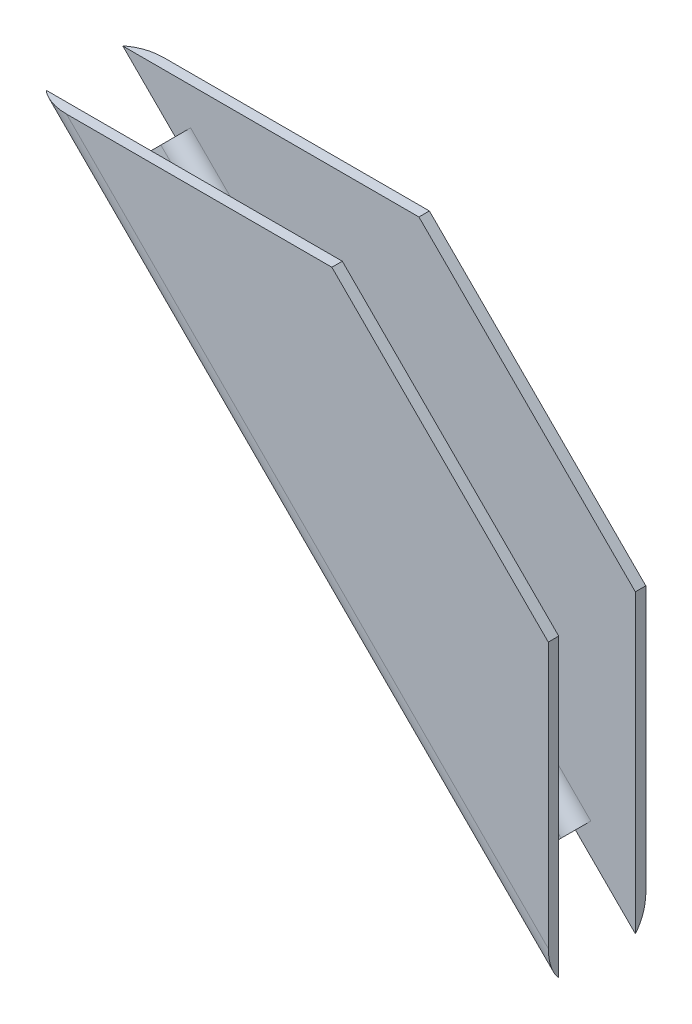
ISO-10303-21;
HEADER;
FILE_DESCRIPTION(('STEP AP214'),'2;1');
FILE_NAME('part.step','',(''),(''),'','','');
FILE_SCHEMA(('AUTOMOTIVE_DESIGN { 1 0 10303 214 1 1 1 1 }'));
ENDSEC;
DATA;
#1=APPLICATION_CONTEXT('core data for automotive mechanical design processes');
#2=APPLICATION_PROTOCOL_DEFINITION('international standard','automotive_design',2000,#1);
#3=PRODUCT_CONTEXT('',#1,'mechanical');
#4=PRODUCT('Part','Part','',(#3));
#5=PRODUCT_RELATED_PRODUCT_CATEGORY('part','',(#4));
#6=PRODUCT_DEFINITION_FORMATION('','',#4);
#7=PRODUCT_DEFINITION_CONTEXT('part definition',#1,'design');
#8=PRODUCT_DEFINITION('design','',#6,#7);
#9=PRODUCT_DEFINITION_SHAPE('','',#8);
#10=(LENGTH_UNIT() NAMED_UNIT(*) SI_UNIT(.MILLI.,.METRE.));
#11=(NAMED_UNIT(*) PLANE_ANGLE_UNIT() SI_UNIT($,.RADIAN.));
#12=(NAMED_UNIT(*) SI_UNIT($,.STERADIAN.) SOLID_ANGLE_UNIT());
#13=UNCERTAINTY_MEASURE_WITH_UNIT(LENGTH_MEASURE(1.E-05),#10,'distance_accuracy_value','');
#14=(GEOMETRIC_REPRESENTATION_CONTEXT(3) GLOBAL_UNCERTAINTY_ASSIGNED_CONTEXT((#13)) GLOBAL_UNIT_ASSIGNED_CONTEXT((#10,
#11,#12)) REPRESENTATION_CONTEXT('',''));
#15=CARTESIAN_POINT('',(0.,0.,0.));
#16=DIRECTION('',(0.,0.,1.));
#17=DIRECTION('',(1.,0.,0.));
#18=AXIS2_PLACEMENT_3D('',#15,#16,#17);
#19=CARTESIAN_POINT('',(162.784789698274,2.20529906949217,7.112));
#20=DIRECTION('',(0.707106781186549,0.707106781186546,0.));
#21=DIRECTION('',(-0.707106781186546,0.707106781186549,0.));
#22=AXIS2_PLACEMENT_3D('',#19,#20,#21);
#23=PLANE('',#22);
#24=DIRECTION('',(0.,0.,1.));
#25=VECTOR('',#24,1.);
#26=CARTESIAN_POINT('',(153.411456803616,11.5786319641501,-7.112));
#27=LINE('',#26,#25);
#28=CARTESIAN_POINT('',(153.411456803616,11.5786319641501,-3.048));
#29=VERTEX_POINT('',#28);
#30=CARTESIAN_POINT('',(153.411456803616,11.5786319641501,3.048));
#31=VERTEX_POINT('',#30);
#32=EDGE_CURVE('E200',#29,#31,#27,.T.);
#33=ORIENTED_EDGE('',*,*,#32,.T.);
#34=DIRECTION('',(0.707106781186546,-0.707106781186549,0.));
#35=VECTOR('',#34,1.);
#36=CARTESIAN_POINT('',(162.784789698274,2.20529906949217,3.048));
#37=LINE('',#36,#35);
#38=CARTESIAN_POINT('',(95.0397920166665,69.9502967510996,3.048));
#39=VERTEX_POINT('',#38);
#40=EDGE_CURVE('E260',#31,#39,#37,.F.);
#41=ORIENTED_EDGE('',*,*,#40,.T.);
#42=DIRECTION('',(0.,0.,1.));
#43=VECTOR('',#42,1.);
#44=CARTESIAN_POINT('',(95.0397920166665,69.9502967510996,-7.112));
#45=LINE('',#44,#43);
#46=CARTESIAN_POINT('',(95.0397920166665,69.9502967510996,-3.048));
#47=VERTEX_POINT('',#46);
#48=EDGE_CURVE('E197',#47,#39,#45,.T.);
#49=ORIENTED_EDGE('',*,*,#48,.F.);
#50=DIRECTION('',(-0.707106781186546,0.707106781186549,0.));
#51=VECTOR('',#50,1.);
#52=CARTESIAN_POINT('',(162.784789698274,2.20529906949217,-3.048));
#53=LINE('',#52,#51);
#54=EDGE_CURVE('E258',#47,#29,#53,.F.);
#55=ORIENTED_EDGE('',*,*,#54,.T.);
#56=EDGE_LOOP('',(#33,#41,#49,#55));
#57=FACE_BOUND('',#56,.T.);
#58=ADVANCED_FACE('F37',(#57),#23,.F.);
#59=CARTESIAN_POINT('',(162.784789698274,46.6552990694923,7.112));
#60=DIRECTION('',(-1.,0.,0.));
#61=DIRECTION('',(0.,0.,1.));
#62=AXIS2_PLACEMENT_3D('',#59,#60,#61);
#63=PLANE('',#62);
#64=DIRECTION('',(0.,1.,0.));
#65=VECTOR('',#64,1.);
#66=CARTESIAN_POINT('',(162.784789698274,46.6552990694923,7.112));
#67=LINE('',#66,#65);
#68=CARTESIAN_POINT('',(162.784789698274,7.95266298697647,7.112));
#69=VERTEX_POINT('',#68);
#70=CARTESIAN_POINT('',(162.784789698274,46.6552990694923,7.112));
#71=VERTEX_POINT('',#70);
#72=EDGE_CURVE('E204',#69,#71,#67,.T.);
#73=ORIENTED_EDGE('',*,*,#72,.F.);
#74=CARTESIAN_POINT('',(162.784789698274,7.95266298697647,3.048));
#75=DIRECTION('',(-1.,0.,0.));
#76=DIRECTION('',(0.,-1.,0.));
#77=AXIS2_PLACEMENT_3D('',#74,#75,#76);
#78=ELLIPSE('',#77,5.74736391748427,4.064);
#79=CARTESIAN_POINT('',(162.784789698274,3.4661284668819,5.588));
#80=VERTEX_POINT('',#79);
#81=EDGE_CURVE('E248',#69,#80,#78,.F.);
#82=ORIENTED_EDGE('',*,*,#81,.T.);
#83=DIRECTION('',(0.,1.,0.));
#84=VECTOR('',#83,1.);
#85=CARTESIAN_POINT('',(162.784789698274,46.6552990694923,5.588));
#86=LINE('',#85,#84);
#87=CARTESIAN_POINT('',(162.784789698274,46.6552990694923,5.588));
#88=VERTEX_POINT('',#87);
#89=EDGE_CURVE('E203',#80,#88,#86,.T.);
#90=ORIENTED_EDGE('',*,*,#89,.T.);
#91=DIRECTION('',(0.,0.,-1.));
#92=VECTOR('',#91,1.);
#93=CARTESIAN_POINT('',(162.784789698274,46.6552990694923,7.112));
#94=LINE('',#93,#92);
#95=EDGE_CURVE('E220',#71,#88,#94,.T.);
#96=ORIENTED_EDGE('',*,*,#95,.F.);
#97=EDGE_LOOP('',(#73,#82,#90,#96));
#98=FACE_BOUND('',#97,.T.);
#99=ADVANCED_FACE('F314',(#98),#63,.F.);
#100=CARTESIAN_POINT('',(131.217325389357,78.2227633784087,7.112));
#101=DIRECTION('',(-0.707106781186549,-0.707106781186546,0.));
#102=DIRECTION('',(0.707106781186546,-0.707106781186549,0.));
#103=AXIS2_PLACEMENT_3D('',#100,#101,#102);
#104=PLANE('',#103);
#105=DIRECTION('',(-0.707106781186546,0.707106781186549,0.));
#106=VECTOR('',#105,1.);
#107=CARTESIAN_POINT('',(131.217325389357,78.2227633784087,5.588));
#108=LINE('',#107,#106);
#109=CARTESIAN_POINT('',(131.217325389357,78.2227633784087,5.588));
#110=VERTEX_POINT('',#109);
#111=EDGE_CURVE('E214',#88,#110,#108,.T.);
#112=ORIENTED_EDGE('',*,*,#111,.T.);
#113=DIRECTION('',(0.,0.,-1.));
#114=VECTOR('',#113,1.);
#115=CARTESIAN_POINT('',(131.217325389357,78.2227633784087,7.112));
#116=LINE('',#115,#114);
#117=CARTESIAN_POINT('',(131.217325389357,78.2227633784087,7.112));
#118=VERTEX_POINT('',#117);
#119=EDGE_CURVE('E212',#118,#110,#116,.T.);
#120=ORIENTED_EDGE('',*,*,#119,.F.);
#121=DIRECTION('',(-0.707106781186546,0.707106781186549,0.));
#122=VECTOR('',#121,1.);
#123=CARTESIAN_POINT('',(131.217325389357,78.2227633784087,7.112));
#124=LINE('',#123,#122);
#125=EDGE_CURVE('E206',#71,#118,#124,.T.);
#126=ORIENTED_EDGE('',*,*,#125,.F.);
#127=ORIENTED_EDGE('',*,*,#95,.T.);
#128=EDGE_LOOP('',(#112,#120,#126,#127));
#129=FACE_BOUND('',#128,.T.);
#130=ADVANCED_FACE('F311',(#129),#104,.F.);
#131=CARTESIAN_POINT('',(86.7673253893574,78.2227633784087,7.112));
#132=DIRECTION('',(0.,-1.,0.));
#133=DIRECTION('',(0.,0.,-1.));
#134=AXIS2_PLACEMENT_3D('',#131,#132,#133);
#135=PLANE('',#134);
#136=DIRECTION('',(-1.,0.,0.));
#137=VECTOR('',#136,1.);
#138=CARTESIAN_POINT('',(86.7673253893574,78.2227633784087,5.588));
#139=LINE('',#138,#137);
#140=CARTESIAN_POINT('',(88.0281547867472,78.2227633784087,5.588));
#141=VERTEX_POINT('',#140);
#142=EDGE_CURVE('E207',#110,#141,#139,.T.);
#143=ORIENTED_EDGE('',*,*,#142,.T.);
#144=CARTESIAN_POINT('',(92.5146893068417,78.2227633784087,3.048));
#145=DIRECTION('',(0.,-1.,0.));
#146=DIRECTION('',(1.,0.,0.));
#147=AXIS2_PLACEMENT_3D('',#144,#145,#146);
#148=ELLIPSE('',#147,5.74736391748425,4.064);
#149=CARTESIAN_POINT('',(92.5146893068417,78.2227633784087,7.112));
#150=VERTEX_POINT('',#149);
#151=EDGE_CURVE('E266',#141,#150,#148,.F.);
#152=ORIENTED_EDGE('',*,*,#151,.T.);
#153=DIRECTION('',(-1.,0.,0.));
#154=VECTOR('',#153,1.);
#155=CARTESIAN_POINT('',(86.7673253893574,78.2227633784087,7.112));
#156=LINE('',#155,#154);
#157=EDGE_CURVE('E209',#118,#150,#156,.T.);
#158=ORIENTED_EDGE('',*,*,#157,.F.);
#159=ORIENTED_EDGE('',*,*,#119,.T.);
#160=EDGE_LOOP('',(#143,#152,#158,#159));
#161=FACE_BOUND('',#160,.T.);
#162=ADVANCED_FACE('F303',(#161),#135,.F.);
#163=CARTESIAN_POINT('',(0.,0.,7.112));
#164=DIRECTION('',(0.,0.,-1.));
#165=DIRECTION('',(-1.,0.,0.));
#166=AXIS2_PLACEMENT_3D('',#163,#164,#165);
#167=PLANE('',#166);
#168=ORIENTED_EDGE('',*,*,#157,.T.);
#169=DIRECTION('',(0.707106781186546,-0.707106781186549,0.));
#170=VECTOR('',#169,1.);
#171=CARTESIAN_POINT('',(85.3687263426254,85.3687263426251,7.112));
#172=LINE('',#171,#170);
#173=EDGE_CURVE('E245',#150,#69,#172,.T.);
#174=ORIENTED_EDGE('',*,*,#173,.T.);
#175=ORIENTED_EDGE('',*,*,#72,.T.);
#176=ORIENTED_EDGE('',*,*,#125,.T.);
#177=EDGE_LOOP('',(#168,#174,#175,#176));
#178=FACE_BOUND('',#177,.T.);
#179=ADVANCED_FACE('F305',(#178),#167,.F.);
#180=CARTESIAN_POINT('',(0.,0.,5.588));
#181=DIRECTION('',(0.,0.,-1.));
#182=DIRECTION('',(-1.,0.,0.));
#183=AXIS2_PLACEMENT_3D('',#180,#181,#182);
#184=PLANE('',#183);
#185=ORIENTED_EDGE('',*,*,#89,.F.);
#186=DIRECTION('',(0.707106781186546,-0.707106781186549,0.));
#187=VECTOR('',#186,1.);
#188=CARTESIAN_POINT('',(162.784789698274,3.46612846688189,5.588));
#189=LINE('',#188,#187);
#190=CARTESIAN_POINT('',(154.041871502311,12.2090466628448,5.588));
#191=VERTEX_POINT('',#190);
#192=EDGE_CURVE('E252',#80,#191,#189,.F.);
#193=ORIENTED_EDGE('',*,*,#192,.T.);
#194=DIRECTION('',(-0.707106781186547,-0.707106781186547,0.));
#195=VECTOR('',#194,1.);
#196=CARTESIAN_POINT('',(153.411456803616,11.5786319641501,5.588));
#197=LINE('',#196,#195);
#198=CARTESIAN_POINT('',(156.285138762358,14.4523139228922,5.588));
#199=VERTEX_POINT('',#198);
#200=EDGE_CURVE('E186',#199,#191,#197,.T.);
#201=ORIENTED_EDGE('',*,*,#200,.F.);
#202=DIRECTION('',(0.707106781186549,-0.707106781186546,0.));
#203=VECTOR('',#202,1.);
#204=CARTESIAN_POINT('',(85.3687263426249,85.3687263426252,5.588));
#205=LINE('',#204,#203);
#206=CARTESIAN_POINT('',(97.9134739754085,72.8239787098416,5.588));
#207=VERTEX_POINT('',#206);
#208=EDGE_CURVE('E229',#199,#207,#205,.F.);
#209=ORIENTED_EDGE('',*,*,#208,.T.);
#210=DIRECTION('',(0.707106781186543,0.707106781186552,0.));
#211=VECTOR('',#210,1.);
#212=CARTESIAN_POINT('',(96.1174227511947,71.0279274856278,5.588));
#213=LINE('',#212,#211);
#214=CARTESIAN_POINT('',(95.6702067153614,70.5807114497944,5.588));
#215=VERTEX_POINT('',#214);
#216=EDGE_CURVE('E189',#215,#207,#213,.T.);
#217=ORIENTED_EDGE('',*,*,#216,.F.);
#218=DIRECTION('',(0.707106781186546,-0.707106781186549,0.));
#219=VECTOR('',#218,1.);
#220=CARTESIAN_POINT('',(95.6702067153614,70.5807114497944,5.588));
#221=LINE('',#220,#219);
#222=EDGE_CURVE('E250',#215,#141,#221,.F.);
#223=ORIENTED_EDGE('',*,*,#222,.T.);
#224=ORIENTED_EDGE('',*,*,#142,.F.);
#225=ORIENTED_EDGE('',*,*,#111,.F.);
#226=EDGE_LOOP('',(#185,#193,#201,#209,#217,#223,#224,#225));
#227=FACE_BOUND('',#226,.T.);
#228=ADVANCED_FACE('F295',(#227),#184,.T.);
#229=CARTESIAN_POINT('',(153.411456803616,11.5786319641501,-7.112));
#230=DIRECTION('',(-0.707106781186548,0.707106781186548,0.));
#231=DIRECTION('',(-0.707106781186548,-0.707106781186548,0.));
#232=AXIS2_PLACEMENT_3D('',#229,#230,#231);
#233=PLANE('',#232);
#234=ORIENTED_EDGE('',*,*,#200,.T.);
#235=CARTESIAN_POINT('',(156.285138762358,14.4523139228921,3.048));
#236=DIRECTION('',(-0.707106781186548,0.707106781186548,0.));
#237=DIRECTION('',(-0.707106781186548,-0.707106781186548,0.));
#238=AXIS2_PLACEMENT_3D('',#235,#236,#237);
#239=CIRCLE('',#238,4.064);
#240=EDGE_CURVE('E256',#191,#31,#239,.F.);
#241=ORIENTED_EDGE('',*,*,#240,.T.);
#242=ORIENTED_EDGE('',*,*,#32,.F.);
#243=CARTESIAN_POINT('',(156.285138762358,14.4523139228921,-3.048));
#244=DIRECTION('',(-0.707106781186548,0.707106781186548,0.));
#245=DIRECTION('',(-0.707106781186548,-0.707106781186548,0.));
#246=AXIS2_PLACEMENT_3D('',#243,#244,#245);
#247=CIRCLE('',#246,4.064);
#248=CARTESIAN_POINT('',(154.041871502311,12.2090466628448,-5.588));
#249=VERTEX_POINT('',#248);
#250=EDGE_CURVE('E254',#29,#249,#247,.F.);
#251=ORIENTED_EDGE('',*,*,#250,.T.);
#252=DIRECTION('',(0.707106781186548,0.707106781186548,0.));
#253=VECTOR('',#252,1.);
#254=CARTESIAN_POINT('',(153.411456803616,11.5786319641501,-5.588));
#255=LINE('',#254,#253);
#256=CARTESIAN_POINT('',(156.285138762358,14.4523139228922,-5.588));
#257=VERTEX_POINT('',#256);
#258=EDGE_CURVE('E184',#249,#257,#255,.T.);
#259=ORIENTED_EDGE('',*,*,#258,.T.);
#260=CARTESIAN_POINT('',(156.285138762358,14.4523139228922,-3.048));
#261=DIRECTION('',(-0.707106781186548,0.707106781186548,0.));
#262=DIRECTION('',(-0.707106781186548,-0.707106781186548,0.));
#263=AXIS2_PLACEMENT_3D('',#260,#261,#262);
#264=CIRCLE('',#263,2.54);
#265=CARTESIAN_POINT('',(154.489087538144,12.6562626986784,-3.048));
#266=VERTEX_POINT('',#265);
#267=EDGE_CURVE('E243',#257,#266,#264,.T.);
#268=ORIENTED_EDGE('',*,*,#267,.T.);
#269=DIRECTION('',(0.,0.,1.));
#270=VECTOR('',#269,1.);
#271=CARTESIAN_POINT('',(154.489087538144,12.6562626986784,-7.112));
#272=LINE('',#271,#270);
#273=CARTESIAN_POINT('',(154.489087538144,12.6562626986784,3.048));
#274=VERTEX_POINT('',#273);
#275=EDGE_CURVE('E191',#266,#274,#272,.T.);
#276=ORIENTED_EDGE('',*,*,#275,.T.);
#277=CARTESIAN_POINT('',(156.285138762358,14.4523139228922,3.048));
#278=DIRECTION('',(-0.707106781186548,0.707106781186548,0.));
#279=DIRECTION('',(-0.707106781186548,-0.707106781186548,0.));
#280=AXIS2_PLACEMENT_3D('',#277,#278,#279);
#281=CIRCLE('',#280,2.54);
#282=EDGE_CURVE('E235',#274,#199,#281,.T.);
#283=ORIENTED_EDGE('',*,*,#282,.T.);
#284=EDGE_LOOP('',(#234,#241,#242,#251,#259,#268,#276,#283));
#285=FACE_BOUND('',#284,.T.);
#286=ADVANCED_FACE('F285',(#285),#233,.F.);
#287=CARTESIAN_POINT('',(96.1174227511947,71.0279274856278,-7.112));
#288=DIRECTION('',(0.707106781186552,-0.707106781186543,0.));
#289=DIRECTION('',(0.707106781186543,0.707106781186552,0.));
#290=AXIS2_PLACEMENT_3D('',#287,#288,#289);
#291=PLANE('',#290);
#292=ORIENTED_EDGE('',*,*,#48,.T.);
#293=CARTESIAN_POINT('',(97.9134739754087,72.8239787098417,3.048));
#294=DIRECTION('',(0.707106781186552,-0.707106781186543,0.));
#295=DIRECTION('',(0.707106781186543,0.707106781186552,0.));
#296=AXIS2_PLACEMENT_3D('',#293,#294,#295);
#297=CIRCLE('',#296,4.064);
#298=EDGE_CURVE('E264',#39,#215,#297,.F.);
#299=ORIENTED_EDGE('',*,*,#298,.T.);
#300=ORIENTED_EDGE('',*,*,#216,.T.);
#301=CARTESIAN_POINT('',(97.9134739754085,72.8239787098416,3.048));
#302=DIRECTION('',(0.707106781186552,-0.707106781186543,0.));
#303=DIRECTION('',(0.707106781186543,0.707106781186552,0.));
#304=AXIS2_PLACEMENT_3D('',#301,#302,#303);
#305=CIRCLE('',#304,2.54);
#306=CARTESIAN_POINT('',(96.1174227511947,71.0279274856278,3.048));
#307=VERTEX_POINT('',#306);
#308=EDGE_CURVE('E238',#207,#307,#305,.T.);
#309=ORIENTED_EDGE('',*,*,#308,.T.);
#310=DIRECTION('',(0.,0.,1.));
#311=VECTOR('',#310,1.);
#312=CARTESIAN_POINT('',(96.1174227511947,71.0279274856278,-7.112));
#313=LINE('',#312,#311);
#314=CARTESIAN_POINT('',(96.1174227511947,71.0279274856278,-3.048));
#315=VERTEX_POINT('',#314);
#316=EDGE_CURVE('E194',#315,#307,#313,.T.);
#317=ORIENTED_EDGE('',*,*,#316,.F.);
#318=CARTESIAN_POINT('',(97.9134739754085,72.8239787098416,-3.048));
#319=DIRECTION('',(0.707106781186552,-0.707106781186543,0.));
#320=DIRECTION('',(0.707106781186543,0.707106781186552,0.));
#321=AXIS2_PLACEMENT_3D('',#318,#319,#320);
#322=CIRCLE('',#321,2.54);
#323=CARTESIAN_POINT('',(97.9134739754085,72.8239787098416,-5.588));
#324=VERTEX_POINT('',#323);
#325=EDGE_CURVE('E240',#315,#324,#322,.T.);
#326=ORIENTED_EDGE('',*,*,#325,.T.);
#327=DIRECTION('',(-0.707106781186543,-0.707106781186552,0.));
#328=VECTOR('',#327,1.);
#329=CARTESIAN_POINT('',(96.1174227511947,71.0279274856278,-5.588));
#330=LINE('',#329,#328);
#331=CARTESIAN_POINT('',(95.6702067153614,70.5807114497944,-5.588));
#332=VERTEX_POINT('',#331);
#333=EDGE_CURVE('E157',#324,#332,#330,.T.);
#334=ORIENTED_EDGE('',*,*,#333,.T.);
#335=CARTESIAN_POINT('',(97.9134739754087,72.8239787098417,-3.048));
#336=DIRECTION('',(0.707106781186552,-0.707106781186543,0.));
#337=DIRECTION('',(0.707106781186543,0.707106781186552,0.));
#338=AXIS2_PLACEMENT_3D('',#335,#336,#337);
#339=CIRCLE('',#338,4.064);
#340=EDGE_CURVE('E262',#332,#47,#339,.F.);
#341=ORIENTED_EDGE('',*,*,#340,.T.);
#342=EDGE_LOOP('',(#292,#299,#300,#309,#317,#326,#334,#341));
#343=FACE_BOUND('',#342,.T.);
#344=ADVANCED_FACE('F275',(#343),#291,.F.);
#345=CARTESIAN_POINT('',(154.489087538144,12.6562626986784,-7.112));
#346=DIRECTION('',(-0.707106781186546,-0.707106781186549,0.));
#347=DIRECTION('',(0.707106781186549,-0.707106781186546,0.));
#348=AXIS2_PLACEMENT_3D('',#345,#346,#347);
#349=PLANE('',#348);
#350=ORIENTED_EDGE('',*,*,#316,.T.);
#351=DIRECTION('',(0.707106781186549,-0.707106781186546,0.));
#352=VECTOR('',#351,1.);
#353=CARTESIAN_POINT('',(154.489087538144,12.6562626986784,3.048));
#354=LINE('',#353,#352);
#355=EDGE_CURVE('E226',#307,#274,#354,.T.);
#356=ORIENTED_EDGE('',*,*,#355,.T.);
#357=ORIENTED_EDGE('',*,*,#275,.F.);
#358=DIRECTION('',(-0.707106781186549,0.707106781186546,0.));
#359=VECTOR('',#358,1.);
#360=CARTESIAN_POINT('',(154.489087538144,12.6562626986784,-3.048));
#361=LINE('',#360,#359);
#362=EDGE_CURVE('E223',#266,#315,#361,.T.);
#363=ORIENTED_EDGE('',*,*,#362,.T.);
#364=EDGE_LOOP('',(#350,#356,#357,#363));
#365=FACE_BOUND('',#364,.T.);
#366=ADVANCED_FACE('F381',(#365),#349,.F.);
#367=CARTESIAN_POINT('',(0.,0.,-7.112));
#368=DIRECTION('',(0.,0.,1.));
#369=DIRECTION('',(1.,0.,0.));
#370=AXIS2_PLACEMENT_3D('',#367,#368,#369);
#371=PLANE('',#370);
#372=DIRECTION('',(0.,1.,0.));
#373=VECTOR('',#372,1.);
#374=CARTESIAN_POINT('',(162.784789698274,46.6552990694923,-7.112));
#375=LINE('',#374,#373);
#376=CARTESIAN_POINT('',(162.784789698274,7.95266298697647,-7.112));
#377=VERTEX_POINT('',#376);
#378=CARTESIAN_POINT('',(162.784789698274,46.6552990694923,-7.112));
#379=VERTEX_POINT('',#378);
#380=EDGE_CURVE('E173',#377,#379,#375,.T.);
#381=ORIENTED_EDGE('',*,*,#380,.F.);
#382=DIRECTION('',(-0.707106781186546,0.707106781186549,0.));
#383=VECTOR('',#382,1.);
#384=CARTESIAN_POINT('',(85.3687263426254,85.3687263426251,-7.112));
#385=LINE('',#384,#383);
#386=CARTESIAN_POINT('',(92.5146893068417,78.2227633784087,-7.112));
#387=VERTEX_POINT('',#386);
#388=EDGE_CURVE('E167',#377,#387,#385,.T.);
#389=ORIENTED_EDGE('',*,*,#388,.T.);
#390=DIRECTION('',(-1.,0.,0.));
#391=VECTOR('',#390,1.);
#392=CARTESIAN_POINT('',(86.7673253893574,78.2227633784087,-7.112));
#393=LINE('',#392,#391);
#394=CARTESIAN_POINT('',(131.217325389357,78.2227633784087,-7.112));
#395=VERTEX_POINT('',#394);
#396=EDGE_CURVE('E151',#395,#387,#393,.T.);
#397=ORIENTED_EDGE('',*,*,#396,.F.);
#398=DIRECTION('',(-0.707106781186546,0.707106781186549,0.));
#399=VECTOR('',#398,1.);
#400=CARTESIAN_POINT('',(131.217325389357,78.2227633784087,-7.112));
#401=LINE('',#400,#399);
#402=EDGE_CURVE('E165',#379,#395,#401,.T.);
#403=ORIENTED_EDGE('',*,*,#402,.F.);
#404=EDGE_LOOP('',(#381,#389,#397,#403));
#405=FACE_BOUND('',#404,.T.);
#406=ADVANCED_FACE('F164',(#405),#371,.F.);
#407=CARTESIAN_POINT('',(0.,0.,-5.588));
#408=DIRECTION('',(0.,0.,1.));
#409=DIRECTION('',(-1.,0.,0.));
#410=AXIS2_PLACEMENT_3D('',#407,#408,#409);
#411=PLANE('',#410);
#412=DIRECTION('',(-1.,0.,0.));
#413=VECTOR('',#412,1.);
#414=CARTESIAN_POINT('',(86.7673253893574,78.2227633784087,-5.588));
#415=LINE('',#414,#413);
#416=CARTESIAN_POINT('',(131.217325389357,78.2227633784087,-5.588));
#417=VERTEX_POINT('',#416);
#418=CARTESIAN_POINT('',(88.0281547867472,78.2227633784087,-5.588));
#419=VERTEX_POINT('',#418);
#420=EDGE_CURVE('E152',#417,#419,#415,.T.);
#421=ORIENTED_EDGE('',*,*,#420,.T.);
#422=DIRECTION('',(-0.707106781186546,0.707106781186549,0.));
#423=VECTOR('',#422,1.);
#424=CARTESIAN_POINT('',(88.0281547867472,78.2227633784087,-5.588));
#425=LINE('',#424,#423);
#426=EDGE_CURVE('E45',#419,#332,#425,.F.);
#427=ORIENTED_EDGE('',*,*,#426,.T.);
#428=ORIENTED_EDGE('',*,*,#333,.F.);
#429=DIRECTION('',(-0.707106781186549,0.707106781186546,0.));
#430=VECTOR('',#429,1.);
#431=CARTESIAN_POINT('',(85.3687263426249,85.3687263426252,-5.588));
#432=LINE('',#431,#430);
#433=EDGE_CURVE('E232',#324,#257,#432,.F.);
#434=ORIENTED_EDGE('',*,*,#433,.T.);
#435=ORIENTED_EDGE('',*,*,#258,.F.);
#436=DIRECTION('',(-0.707106781186546,0.707106781186549,0.));
#437=VECTOR('',#436,1.);
#438=CARTESIAN_POINT('',(154.041871502311,12.2090466628448,-5.588));
#439=LINE('',#438,#437);
#440=CARTESIAN_POINT('',(162.784789698274,3.46612846688191,-5.588));
#441=VERTEX_POINT('',#440);
#442=EDGE_CURVE('E52',#249,#441,#439,.F.);
#443=ORIENTED_EDGE('',*,*,#442,.T.);
#444=DIRECTION('',(0.,1.,0.));
#445=VECTOR('',#444,1.);
#446=CARTESIAN_POINT('',(162.784789698274,46.6552990694923,-5.588));
#447=LINE('',#446,#445);
#448=CARTESIAN_POINT('',(162.784789698274,46.6552990694923,-5.588));
#449=VERTEX_POINT('',#448);
#450=EDGE_CURVE('E168',#441,#449,#447,.T.);
#451=ORIENTED_EDGE('',*,*,#450,.T.);
#452=DIRECTION('',(-0.707106781186546,0.707106781186549,0.));
#453=VECTOR('',#452,1.);
#454=CARTESIAN_POINT('',(131.217325389357,78.2227633784087,-5.588));
#455=LINE('',#454,#453);
#456=EDGE_CURVE('E178',#449,#417,#455,.T.);
#457=ORIENTED_EDGE('',*,*,#456,.T.);
#458=EDGE_LOOP('',(#421,#427,#428,#434,#435,#443,#451,#457));
#459=FACE_BOUND('',#458,.T.);
#460=ADVANCED_FACE('F271',(#459),#411,.T.);
#461=CARTESIAN_POINT('',(86.7673253893574,78.2227633784087,-7.112));
#462=DIRECTION('',(0.,1.,0.));
#463=DIRECTION('',(0.,0.,1.));
#464=AXIS2_PLACEMENT_3D('',#461,#462,#463);
#465=PLANE('',#464);
#466=ORIENTED_EDGE('',*,*,#396,.T.);
#467=CARTESIAN_POINT('',(92.5146893068417,78.2227633784087,-3.048));
#468=DIRECTION('',(0.,1.,0.));
#469=DIRECTION('',(-1.,0.,0.));
#470=AXIS2_PLACEMENT_3D('',#467,#468,#469);
#471=ELLIPSE('',#470,5.74736391748425,4.064);
#472=EDGE_CURVE('E60',#387,#419,#471,.T.);
#473=ORIENTED_EDGE('',*,*,#472,.T.);
#474=ORIENTED_EDGE('',*,*,#420,.F.);
#475=DIRECTION('',(0.,0.,1.));
#476=VECTOR('',#475,1.);
#477=CARTESIAN_POINT('',(131.217325389357,78.2227633784087,-7.112));
#478=LINE('',#477,#476);
#479=EDGE_CURVE('E148',#395,#417,#478,.T.);
#480=ORIENTED_EDGE('',*,*,#479,.F.);
#481=EDGE_LOOP('',(#466,#473,#474,#480));
#482=FACE_BOUND('',#481,.T.);
#483=ADVANCED_FACE('F150',(#482),#465,.T.);
#484=CARTESIAN_POINT('',(131.217325389357,78.2227633784087,-7.112));
#485=DIRECTION('',(0.707106781186549,0.707106781186546,0.));
#486=DIRECTION('',(-0.707106781186546,0.707106781186549,0.));
#487=AXIS2_PLACEMENT_3D('',#484,#485,#486);
#488=PLANE('',#487);
#489=ORIENTED_EDGE('',*,*,#456,.F.);
#490=DIRECTION('',(0.,0.,1.));
#491=VECTOR('',#490,1.);
#492=CARTESIAN_POINT('',(162.784789698274,46.6552990694923,-7.112));
#493=LINE('',#492,#491);
#494=EDGE_CURVE('E158',#379,#449,#493,.T.);
#495=ORIENTED_EDGE('',*,*,#494,.F.);
#496=ORIENTED_EDGE('',*,*,#402,.T.);
#497=ORIENTED_EDGE('',*,*,#479,.T.);
#498=EDGE_LOOP('',(#489,#495,#496,#497));
#499=FACE_BOUND('',#498,.T.);
#500=ADVANCED_FACE('F171',(#499),#488,.T.);
#501=CARTESIAN_POINT('',(162.784789698274,46.6552990694923,-7.112));
#502=DIRECTION('',(1.,0.,0.));
#503=DIRECTION('',(0.,0.,-1.));
#504=AXIS2_PLACEMENT_3D('',#501,#502,#503);
#505=PLANE('',#504);
#506=ORIENTED_EDGE('',*,*,#450,.F.);
#507=CARTESIAN_POINT('',(162.784789698274,7.95266298697647,-3.048));
#508=DIRECTION('',(1.,0.,0.));
#509=DIRECTION('',(0.,1.,0.));
#510=AXIS2_PLACEMENT_3D('',#507,#508,#509);
#511=ELLIPSE('',#510,5.74736391748427,4.064);
#512=EDGE_CURVE('E11',#441,#377,#511,.T.);
#513=ORIENTED_EDGE('',*,*,#512,.T.);
#514=ORIENTED_EDGE('',*,*,#380,.T.);
#515=ORIENTED_EDGE('',*,*,#494,.T.);
#516=EDGE_LOOP('',(#506,#513,#514,#515));
#517=FACE_BOUND('',#516,.T.);
#518=ADVANCED_FACE('F329',(#517),#505,.T.);
#519=CARTESIAN_POINT('',(156.285138762358,14.4523139228922,3.048));
#520=DIRECTION('',(0.707106781186549,-0.707106781186546,0.));
#521=DIRECTION('',(0.707106781186546,0.707106781186549,0.));
#522=AXIS2_PLACEMENT_3D('',#519,#520,#521);
#523=CYLINDRICAL_SURFACE('',#522,2.54);
#524=ORIENTED_EDGE('',*,*,#308,.F.);
#525=ORIENTED_EDGE('',*,*,#208,.F.);
#526=ORIENTED_EDGE('',*,*,#282,.F.);
#527=ORIENTED_EDGE('',*,*,#355,.F.);
#528=EDGE_LOOP('',(#524,#525,#526,#527));
#529=FACE_BOUND('',#528,.T.);
#530=ADVANCED_FACE('F325',(#529),#523,.F.);
#531=CARTESIAN_POINT('',(156.285138762358,14.4523139228922,-3.048));
#532=DIRECTION('',(-0.707106781186549,0.707106781186546,0.));
#533=DIRECTION('',(-0.707106781186546,-0.707106781186549,0.));
#534=AXIS2_PLACEMENT_3D('',#531,#532,#533);
#535=CYLINDRICAL_SURFACE('',#534,2.54);
#536=ORIENTED_EDGE('',*,*,#267,.F.);
#537=ORIENTED_EDGE('',*,*,#433,.F.);
#538=ORIENTED_EDGE('',*,*,#325,.F.);
#539=ORIENTED_EDGE('',*,*,#362,.F.);
#540=EDGE_LOOP('',(#536,#537,#538,#539));
#541=FACE_BOUND('',#540,.T.);
#542=ADVANCED_FACE('F328',(#541),#535,.F.);
#543=CARTESIAN_POINT('',(85.3687263426254,85.3687263426251,3.048));
#544=DIRECTION('',(0.707106781186546,-0.707106781186549,0.));
#545=DIRECTION('',(0.707106781186549,0.707106781186546,0.));
#546=AXIS2_PLACEMENT_3D('',#543,#544,#545);
#547=CYLINDRICAL_SURFACE('',#546,4.064);
#548=ORIENTED_EDGE('',*,*,#298,.F.);
#549=ORIENTED_EDGE('',*,*,#40,.F.);
#550=ORIENTED_EDGE('',*,*,#240,.F.);
#551=ORIENTED_EDGE('',*,*,#192,.F.);
#552=ORIENTED_EDGE('',*,*,#81,.F.);
#553=ORIENTED_EDGE('',*,*,#173,.F.);
#554=ORIENTED_EDGE('',*,*,#151,.F.);
#555=ORIENTED_EDGE('',*,*,#222,.F.);
#556=EDGE_LOOP('',(#548,#549,#550,#551,#552,#553,#554,#555));
#557=FACE_BOUND('',#556,.T.);
#558=ADVANCED_FACE('F290',(#557),#547,.T.);
#559=CARTESIAN_POINT('',(85.3687263426254,85.3687263426251,-3.048));
#560=DIRECTION('',(-0.707106781186546,0.707106781186549,0.));
#561=DIRECTION('',(-0.707106781186549,-0.707106781186546,0.));
#562=AXIS2_PLACEMENT_3D('',#559,#560,#561);
#563=CYLINDRICAL_SURFACE('',#562,4.064);
#564=ORIENTED_EDGE('',*,*,#250,.F.);
#565=ORIENTED_EDGE('',*,*,#54,.F.);
#566=ORIENTED_EDGE('',*,*,#340,.F.);
#567=ORIENTED_EDGE('',*,*,#426,.F.);
#568=ORIENTED_EDGE('',*,*,#472,.F.);
#569=ORIENTED_EDGE('',*,*,#388,.F.);
#570=ORIENTED_EDGE('',*,*,#512,.F.);
#571=ORIENTED_EDGE('',*,*,#442,.F.);
#572=EDGE_LOOP('',(#564,#565,#566,#567,#568,#569,#570,#571));
#573=FACE_BOUND('',#572,.T.);
#574=ADVANCED_FACE('F39',(#573),#563,.T.);
#575=CLOSED_SHELL('',(#58,#99,#130,#162,#179,#228,#286,#344,#366,#406,#460,#483,#500,#518,#530,
#542,#558,#574));
#576=MANIFOLD_SOLID_BREP('B2',#575);
#577=ADVANCED_BREP_SHAPE_REPRESENTATION('',(#18,#576),#14);
#578=SHAPE_DEFINITION_REPRESENTATION(#9,#577);
ENDSEC;
END-ISO-10303-21;
